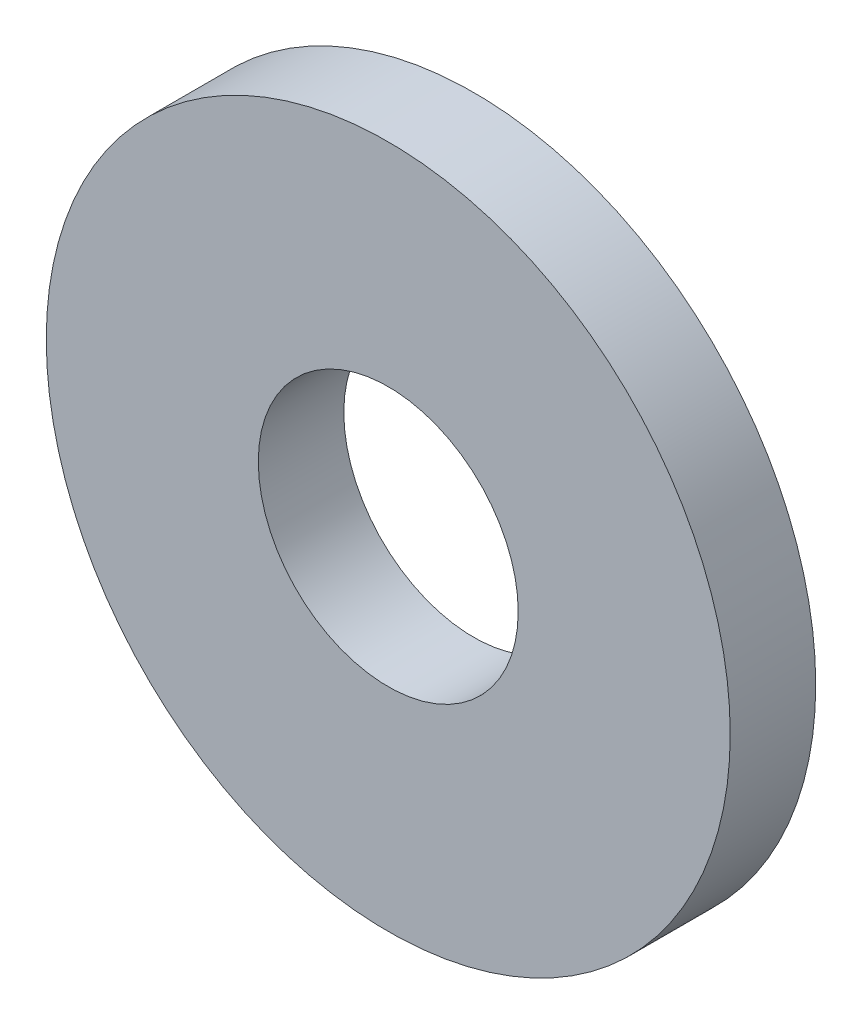
ISO-10303-21;
HEADER;
FILE_DESCRIPTION(('STEP AP214'),'2;1');
FILE_NAME('part.step','',(''),(''),'','','');
FILE_SCHEMA(('AUTOMOTIVE_DESIGN { 1 0 10303 214 1 1 1 1 }'));
ENDSEC;
DATA;
#1=APPLICATION_CONTEXT('core data for automotive mechanical design processes');
#2=APPLICATION_PROTOCOL_DEFINITION('international standard','automotive_design',2000,#1);
#3=PRODUCT_CONTEXT('',#1,'mechanical');
#4=PRODUCT('Part','Part','',(#3));
#5=PRODUCT_RELATED_PRODUCT_CATEGORY('part','',(#4));
#6=PRODUCT_DEFINITION_FORMATION('','',#4);
#7=PRODUCT_DEFINITION_CONTEXT('part definition',#1,'design');
#8=PRODUCT_DEFINITION('design','',#6,#7);
#9=PRODUCT_DEFINITION_SHAPE('','',#8);
#10=(LENGTH_UNIT() NAMED_UNIT(*) SI_UNIT(.MILLI.,.METRE.));
#11=(NAMED_UNIT(*) PLANE_ANGLE_UNIT() SI_UNIT($,.RADIAN.));
#12=(NAMED_UNIT(*) SI_UNIT($,.STERADIAN.) SOLID_ANGLE_UNIT());
#13=UNCERTAINTY_MEASURE_WITH_UNIT(LENGTH_MEASURE(1.E-05),#10,'distance_accuracy_value','');
#14=(GEOMETRIC_REPRESENTATION_CONTEXT(3) GLOBAL_UNCERTAINTY_ASSIGNED_CONTEXT((#13)) GLOBAL_UNIT_ASSIGNED_CONTEXT((#10,
#11,#12)) REPRESENTATION_CONTEXT('',''));
#15=CARTESIAN_POINT('',(0.,0.,0.));
#16=DIRECTION('',(0.,0.,1.));
#17=DIRECTION('',(1.,0.,0.));
#18=AXIS2_PLACEMENT_3D('',#15,#16,#17);
#19=CARTESIAN_POINT('',(0.,0.,3.175));
#20=DIRECTION('',(0.,0.,-1.));
#21=DIRECTION('',(-1.,0.,0.));
#22=AXIS2_PLACEMENT_3D('',#19,#20,#21);
#23=PLANE('',#22);
#24=CARTESIAN_POINT('',(0.,0.,3.175));
#25=DIRECTION('',(0.,0.,1.));
#26=DIRECTION('',(1.,0.,0.));
#27=AXIS2_PLACEMENT_3D('',#24,#25,#26);
#28=CIRCLE('',#27,4.826);
#29=CARTESIAN_POINT('',(4.826,0.,3.175));
#30=VERTEX_POINT('',#29);
#31=EDGE_CURVE('E27',#30,#30,#28,.F.);
#32=ORIENTED_EDGE('',*,*,#31,.T.);
#33=EDGE_LOOP('',(#32));
#34=FACE_BOUND('',#33,.T.);
#35=CARTESIAN_POINT('',(0.,0.,3.175));
#36=DIRECTION('',(0.,0.,1.));
#37=DIRECTION('',(1.,0.,0.));
#38=AXIS2_PLACEMENT_3D('',#35,#36,#37);
#39=CIRCLE('',#38,12.7);
#40=CARTESIAN_POINT('',(12.7,0.,3.175));
#41=VERTEX_POINT('',#40);
#42=EDGE_CURVE('E18',#41,#41,#39,.F.);
#43=ORIENTED_EDGE('',*,*,#42,.F.);
#44=EDGE_LOOP('',(#43));
#45=FACE_BOUND('',#44,.T.);
#46=ADVANCED_FACE('F15',(#34,#45),#23,.F.);
#47=CARTESIAN_POINT('',(0.,0.,0.));
#48=DIRECTION('',(0.,0.,1.));
#49=DIRECTION('',(1.,0.,0.));
#50=AXIS2_PLACEMENT_3D('',#47,#48,#49);
#51=CYLINDRICAL_SURFACE('',#50,12.7);
#52=CARTESIAN_POINT('',(0.,0.,0.));
#53=DIRECTION('',(0.,0.,1.));
#54=DIRECTION('',(1.,0.,0.));
#55=AXIS2_PLACEMENT_3D('',#52,#53,#54);
#56=CIRCLE('',#55,12.7);
#57=CARTESIAN_POINT('',(12.7,0.,0.));
#58=VERTEX_POINT('',#57);
#59=EDGE_CURVE('E22',#58,#58,#56,.F.);
#60=ORIENTED_EDGE('',*,*,#59,.F.);
#61=EDGE_LOOP('',(#60));
#62=FACE_BOUND('',#61,.T.);
#63=ORIENTED_EDGE('',*,*,#42,.T.);
#64=EDGE_LOOP('',(#63));
#65=FACE_BOUND('',#64,.T.);
#66=ADVANCED_FACE('F35',(#62,#65),#51,.T.);
#67=CARTESIAN_POINT('',(0.,0.,0.));
#68=DIRECTION('',(0.,0.,1.));
#69=DIRECTION('',(1.,0.,0.));
#70=AXIS2_PLACEMENT_3D('',#67,#68,#69);
#71=CYLINDRICAL_SURFACE('',#70,4.826);
#72=CARTESIAN_POINT('',(0.,0.,0.));
#73=DIRECTION('',(0.,0.,1.));
#74=DIRECTION('',(1.,0.,0.));
#75=AXIS2_PLACEMENT_3D('',#72,#73,#74);
#76=CIRCLE('',#75,4.826);
#77=CARTESIAN_POINT('',(4.826,0.,0.));
#78=VERTEX_POINT('',#77);
#79=EDGE_CURVE('E10',#78,#78,#76,.T.);
#80=ORIENTED_EDGE('',*,*,#79,.F.);
#81=EDGE_LOOP('',(#80));
#82=FACE_BOUND('',#81,.T.);
#83=ORIENTED_EDGE('',*,*,#31,.F.);
#84=EDGE_LOOP('',(#83));
#85=FACE_BOUND('',#84,.T.);
#86=ADVANCED_FACE('F42',(#82,#85),#71,.F.);
#87=CARTESIAN_POINT('',(0.,0.,0.));
#88=DIRECTION('',(0.,0.,-1.));
#89=DIRECTION('',(-1.,0.,0.));
#90=AXIS2_PLACEMENT_3D('',#87,#88,#89);
#91=PLANE('',#90);
#92=ORIENTED_EDGE('',*,*,#79,.T.);
#93=EDGE_LOOP('',(#92));
#94=FACE_BOUND('',#93,.T.);
#95=ORIENTED_EDGE('',*,*,#59,.T.);
#96=EDGE_LOOP('',(#95));
#97=FACE_BOUND('',#96,.T.);
#98=ADVANCED_FACE('F44',(#94,#97),#91,.T.);
#99=CLOSED_SHELL('',(#46,#66,#86,#98));
#100=MANIFOLD_SOLID_BREP('B1',#99);
#101=ADVANCED_BREP_SHAPE_REPRESENTATION('',(#18,#100),#14);
#102=SHAPE_DEFINITION_REPRESENTATION(#9,#101);
ENDSEC;
END-ISO-10303-21;
